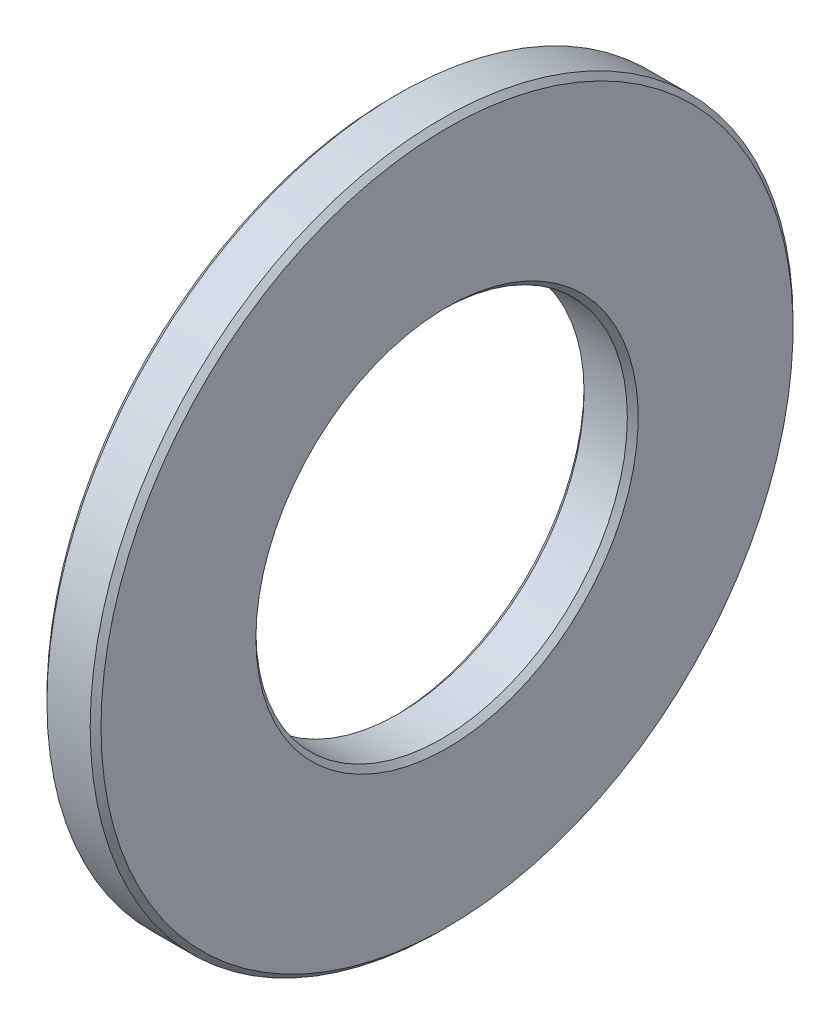
ISO-10303-21;
HEADER;
FILE_DESCRIPTION(('STEP AP214'),'2;1');
FILE_NAME('part.step','',(''),(''),'','','');
FILE_SCHEMA(('AUTOMOTIVE_DESIGN { 1 0 10303 214 1 1 1 1 }'));
ENDSEC;
DATA;
#1=APPLICATION_CONTEXT('core data for automotive mechanical design processes');
#2=APPLICATION_PROTOCOL_DEFINITION('international standard','automotive_design',2000,#1);
#3=PRODUCT_CONTEXT('',#1,'mechanical');
#4=PRODUCT('Part','Part','',(#3));
#5=PRODUCT_RELATED_PRODUCT_CATEGORY('part','',(#4));
#6=PRODUCT_DEFINITION_FORMATION('','',#4);
#7=PRODUCT_DEFINITION_CONTEXT('part definition',#1,'design');
#8=PRODUCT_DEFINITION('design','',#6,#7);
#9=PRODUCT_DEFINITION_SHAPE('','',#8);
#10=(LENGTH_UNIT() NAMED_UNIT(*) SI_UNIT(.MILLI.,.METRE.));
#11=(NAMED_UNIT(*) PLANE_ANGLE_UNIT() SI_UNIT($,.RADIAN.));
#12=(NAMED_UNIT(*) SI_UNIT($,.STERADIAN.) SOLID_ANGLE_UNIT());
#13=UNCERTAINTY_MEASURE_WITH_UNIT(LENGTH_MEASURE(1.E-05),#10,'distance_accuracy_value','');
#14=(GEOMETRIC_REPRESENTATION_CONTEXT(3) GLOBAL_UNCERTAINTY_ASSIGNED_CONTEXT((#13)) GLOBAL_UNIT_ASSIGNED_CONTEXT((#10,
#11,#12)) REPRESENTATION_CONTEXT('',''));
#15=CARTESIAN_POINT('',(0.,0.,0.));
#16=DIRECTION('',(0.,0.,1.));
#17=DIRECTION('',(1.,0.,0.));
#18=AXIS2_PLACEMENT_3D('',#15,#16,#17);
#19=CARTESIAN_POINT('',(-34.9249999999999,0.,0.));
#20=DIRECTION('',(-1.,0.,0.));
#21=DIRECTION('',(0.,0.,1.));
#22=AXIS2_PLACEMENT_3D('',#19,#20,#21);
#23=CYLINDRICAL_SURFACE('',#22,3.435);
#24=CARTESIAN_POINT('',(-0.0999999999999959,0.,0.));
#25=DIRECTION('',(-1.,0.,0.));
#26=DIRECTION('',(0.,0.,1.));
#27=AXIS2_PLACEMENT_3D('',#24,#25,#26);
#28=CIRCLE('',#27,3.435);
#29=CARTESIAN_POINT('',(-0.0999999999999959,0.,3.435));
#30=VERTEX_POINT('',#29);
#31=EDGE_CURVE('E61',#30,#30,#28,.F.);
#32=ORIENTED_EDGE('',*,*,#31,.T.);
#33=EDGE_LOOP('',(#32));
#34=FACE_BOUND('',#33,.T.);
#35=CARTESIAN_POINT('',(-0.900000000000006,0.,0.));
#36=DIRECTION('',(1.,0.,0.));
#37=DIRECTION('',(0.,0.,-1.));
#38=AXIS2_PLACEMENT_3D('',#35,#36,#37);
#39=CIRCLE('',#38,3.435);
#40=CARTESIAN_POINT('',(-0.900000000000006,0.,-3.435));
#41=VERTEX_POINT('',#40);
#42=EDGE_CURVE('E46',#41,#41,#39,.F.);
#43=ORIENTED_EDGE('',*,*,#42,.T.);
#44=EDGE_LOOP('',(#43));
#45=FACE_BOUND('',#44,.T.);
#46=ADVANCED_FACE('F41',(#34,#45),#23,.F.);
#47=CARTESIAN_POINT('',(0.,3.435,0.));
#48=DIRECTION('',(-1.,0.,0.));
#49=DIRECTION('',(0.,0.,1.));
#50=AXIS2_PLACEMENT_3D('',#47,#48,#49);
#51=PLANE('',#50);
#52=CARTESIAN_POINT('',(0.,0.,0.));
#53=DIRECTION('',(-1.,0.,0.));
#54=DIRECTION('',(0.,0.,1.));
#55=AXIS2_PLACEMENT_3D('',#52,#53,#54);
#56=CIRCLE('',#55,3.535);
#57=CARTESIAN_POINT('',(0.,0.,3.535));
#58=VERTEX_POINT('',#57);
#59=EDGE_CURVE('E69',#58,#58,#56,.T.);
#60=ORIENTED_EDGE('',*,*,#59,.T.);
#61=EDGE_LOOP('',(#60));
#62=FACE_BOUND('',#61,.T.);
#63=CARTESIAN_POINT('',(0.,0.,0.));
#64=DIRECTION('',(-1.,0.,0.));
#65=DIRECTION('',(0.,0.,1.));
#66=AXIS2_PLACEMENT_3D('',#63,#64,#65);
#67=CIRCLE('',#66,6.4);
#68=CARTESIAN_POINT('',(0.,0.,6.4));
#69=VERTEX_POINT('',#68);
#70=EDGE_CURVE('E73',#69,#69,#67,.F.);
#71=ORIENTED_EDGE('',*,*,#70,.T.);
#72=EDGE_LOOP('',(#71));
#73=FACE_BOUND('',#72,.T.);
#74=ADVANCED_FACE('F77',(#62,#73),#51,.F.);
#75=CARTESIAN_POINT('',(-34.9249999999999,0.,0.));
#76=DIRECTION('',(-1.,0.,0.));
#77=DIRECTION('',(0.,0.,1.));
#78=AXIS2_PLACEMENT_3D('',#75,#76,#77);
#79=CYLINDRICAL_SURFACE('',#78,6.5);
#80=CARTESIAN_POINT('',(-0.100000000000003,0.,0.));
#81=DIRECTION('',(-1.,0.,0.));
#82=DIRECTION('',(0.,0.,1.));
#83=AXIS2_PLACEMENT_3D('',#80,#81,#82);
#84=CIRCLE('',#83,6.5);
#85=CARTESIAN_POINT('',(-0.100000000000003,0.,6.5));
#86=VERTEX_POINT('',#85);
#87=EDGE_CURVE('E55',#86,#86,#84,.T.);
#88=ORIENTED_EDGE('',*,*,#87,.T.);
#89=EDGE_LOOP('',(#88));
#90=FACE_BOUND('',#89,.T.);
#91=CARTESIAN_POINT('',(-0.899999999999999,0.,0.));
#92=DIRECTION('',(1.,0.,0.));
#93=DIRECTION('',(0.,0.,-1.));
#94=AXIS2_PLACEMENT_3D('',#91,#92,#93);
#95=CIRCLE('',#94,6.5);
#96=CARTESIAN_POINT('',(-0.899999999999999,0.,-6.5));
#97=VERTEX_POINT('',#96);
#98=EDGE_CURVE('E59',#97,#97,#95,.T.);
#99=ORIENTED_EDGE('',*,*,#98,.T.);
#100=EDGE_LOOP('',(#99));
#101=FACE_BOUND('',#100,.T.);
#102=ADVANCED_FACE('F87',(#90,#101),#79,.T.);
#103=CARTESIAN_POINT('',(-1.,6.5,0.));
#104=DIRECTION('',(1.,0.,0.));
#105=DIRECTION('',(0.,0.,-1.));
#106=AXIS2_PLACEMENT_3D('',#103,#104,#105);
#107=PLANE('',#106);
#108=CARTESIAN_POINT('',(-1.,0.,0.));
#109=DIRECTION('',(1.,0.,0.));
#110=DIRECTION('',(0.,0.,-1.));
#111=AXIS2_PLACEMENT_3D('',#108,#109,#110);
#112=CIRCLE('',#111,6.4);
#113=CARTESIAN_POINT('',(-1.,0.,-6.4));
#114=VERTEX_POINT('',#113);
#115=EDGE_CURVE('E11',#114,#114,#112,.F.);
#116=ORIENTED_EDGE('',*,*,#115,.T.);
#117=EDGE_LOOP('',(#116));
#118=FACE_BOUND('',#117,.T.);
#119=CARTESIAN_POINT('',(-1.,0.,0.));
#120=DIRECTION('',(1.,0.,0.));
#121=DIRECTION('',(0.,0.,-1.));
#122=AXIS2_PLACEMENT_3D('',#119,#120,#121);
#123=CIRCLE('',#122,3.535);
#124=CARTESIAN_POINT('',(-1.,0.,-3.535));
#125=VERTEX_POINT('',#124);
#126=EDGE_CURVE('E50',#125,#125,#123,.T.);
#127=ORIENTED_EDGE('',*,*,#126,.T.);
#128=EDGE_LOOP('',(#127));
#129=FACE_BOUND('',#128,.T.);
#130=ADVANCED_FACE('F89',(#118,#129),#107,.F.);
#131=CARTESIAN_POINT('',(0.,0.,0.));
#132=DIRECTION('',(1.,0.,0.));
#133=DIRECTION('',(0.,0.,-1.));
#134=AXIS2_PLACEMENT_3D('',#131,#132,#133);
#135=CONICAL_SURFACE('',#134,3.535,0.78539816339745);
#136=ORIENTED_EDGE('',*,*,#31,.F.);
#137=EDGE_LOOP('',(#136));
#138=FACE_BOUND('',#137,.T.);
#139=ORIENTED_EDGE('',*,*,#59,.F.);
#140=EDGE_LOOP('',(#139));
#141=FACE_BOUND('',#140,.T.);
#142=ADVANCED_FACE('F83',(#138,#141),#135,.F.);
#143=CARTESIAN_POINT('',(-0.100000000000003,0.,0.));
#144=DIRECTION('',(-1.,0.,0.));
#145=DIRECTION('',(0.,0.,1.));
#146=AXIS2_PLACEMENT_3D('',#143,#144,#145);
#147=CONICAL_SURFACE('',#146,6.5,0.785398163397448);
#148=ORIENTED_EDGE('',*,*,#70,.F.);
#149=EDGE_LOOP('',(#148));
#150=FACE_BOUND('',#149,.T.);
#151=ORIENTED_EDGE('',*,*,#87,.F.);
#152=EDGE_LOOP('',(#151));
#153=FACE_BOUND('',#152,.T.);
#154=ADVANCED_FACE('F79',(#150,#153),#147,.T.);
#155=CARTESIAN_POINT('',(-1.,0.,0.));
#156=DIRECTION('',(1.,0.,0.));
#157=DIRECTION('',(0.,0.,-1.));
#158=AXIS2_PLACEMENT_3D('',#155,#156,#157);
#159=CONICAL_SURFACE('',#158,6.4,0.785398163397427);
#160=ORIENTED_EDGE('',*,*,#98,.F.);
#161=EDGE_LOOP('',(#160));
#162=FACE_BOUND('',#161,.T.);
#163=ORIENTED_EDGE('',*,*,#115,.F.);
#164=EDGE_LOOP('',(#163));
#165=FACE_BOUND('',#164,.T.);
#166=ADVANCED_FACE('F82',(#162,#165),#159,.T.);
#167=CARTESIAN_POINT('',(-0.900000000000006,0.,0.));
#168=DIRECTION('',(-1.,0.,0.));
#169=DIRECTION('',(0.,0.,1.));
#170=AXIS2_PLACEMENT_3D('',#167,#168,#169);
#171=CONICAL_SURFACE('',#170,3.435,0.78539816339745);
#172=ORIENTED_EDGE('',*,*,#126,.F.);
#173=EDGE_LOOP('',(#172));
#174=FACE_BOUND('',#173,.T.);
#175=ORIENTED_EDGE('',*,*,#42,.F.);
#176=EDGE_LOOP('',(#175));
#177=FACE_BOUND('',#176,.T.);
#178=ADVANCED_FACE('F44',(#174,#177),#171,.F.);
#179=CLOSED_SHELL('',(#46,#74,#102,#130,#142,#154,#166,#178));
#180=MANIFOLD_SOLID_BREP('B2',#179);
#181=ADVANCED_BREP_SHAPE_REPRESENTATION('',(#18,#180),#14);
#182=SHAPE_DEFINITION_REPRESENTATION(#9,#181);
ENDSEC;
END-ISO-10303-21;
